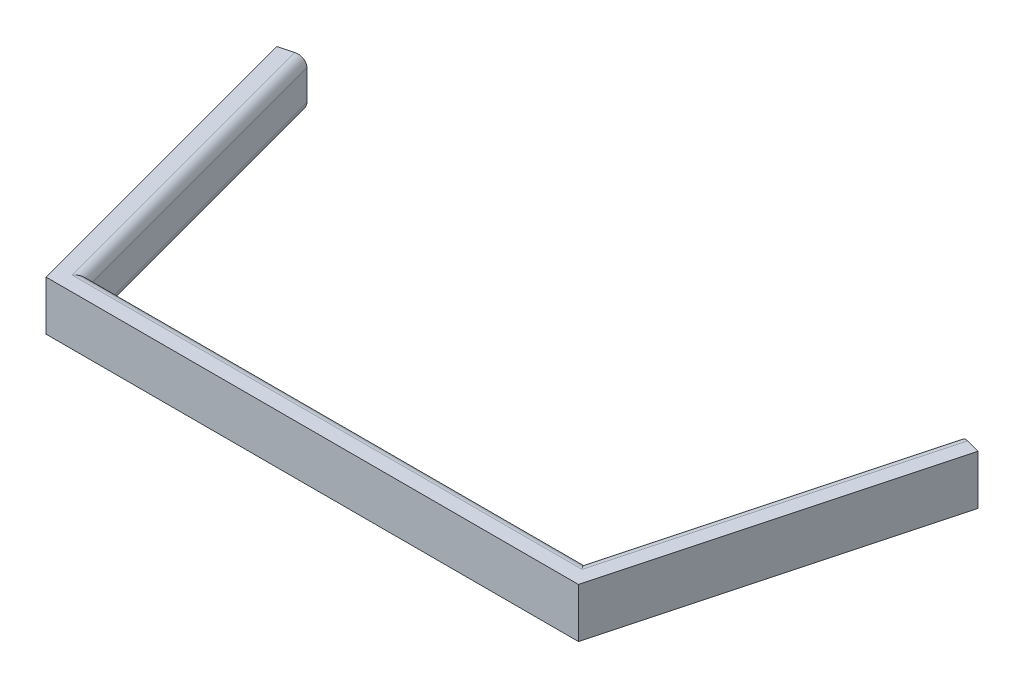
ISO-10303-21;
HEADER;
FILE_DESCRIPTION(('STEP AP214'),'2;1');
FILE_NAME('part.step','',(''),(''),'','','');
FILE_SCHEMA(('AUTOMOTIVE_DESIGN { 1 0 10303 214 1 1 1 1 }'));
ENDSEC;
DATA;
#1=APPLICATION_CONTEXT('core data for automotive mechanical design processes');
#2=APPLICATION_PROTOCOL_DEFINITION('international standard','automotive_design',2000,#1);
#3=PRODUCT_CONTEXT('',#1,'mechanical');
#4=PRODUCT('Part','Part','',(#3));
#5=PRODUCT_RELATED_PRODUCT_CATEGORY('part','',(#4));
#6=PRODUCT_DEFINITION_FORMATION('','',#4);
#7=PRODUCT_DEFINITION_CONTEXT('part definition',#1,'design');
#8=PRODUCT_DEFINITION('design','',#6,#7);
#9=PRODUCT_DEFINITION_SHAPE('','',#8);
#10=(LENGTH_UNIT() NAMED_UNIT(*) SI_UNIT(.MILLI.,.METRE.));
#11=(NAMED_UNIT(*) PLANE_ANGLE_UNIT() SI_UNIT($,.RADIAN.));
#12=(NAMED_UNIT(*) SI_UNIT($,.STERADIAN.) SOLID_ANGLE_UNIT());
#13=UNCERTAINTY_MEASURE_WITH_UNIT(LENGTH_MEASURE(1.E-05),#10,'distance_accuracy_value','');
#14=(GEOMETRIC_REPRESENTATION_CONTEXT(3) GLOBAL_UNCERTAINTY_ASSIGNED_CONTEXT((#13)) GLOBAL_UNIT_ASSIGNED_CONTEXT((#10,
#11,#12)) REPRESENTATION_CONTEXT('',''));
#15=CARTESIAN_POINT('',(0.,0.,0.));
#16=DIRECTION('',(0.,0.,1.));
#17=DIRECTION('',(1.,0.,0.));
#18=AXIS2_PLACEMENT_3D('',#15,#16,#17);
#19=CARTESIAN_POINT('',(-159.850411615286,12.7,-55.8538988702843));
#20=DIRECTION('',(-0.258819045102518,0.,-0.965925826289069));
#21=DIRECTION('',(-0.965925826289069,0.,0.258819045102518));
#22=AXIS2_PLACEMENT_3D('',#19,#20,#21);
#23=PLANE('',#22);
#24=DIRECTION('',(0.,-1.,0.));
#25=VECTOR('',#24,1.);
#26=CARTESIAN_POINT('',(-83.9177284632513,12.7,-76.2));
#27=LINE('',#26,#25);
#28=CARTESIAN_POINT('',(-83.9177284632513,10.16,-76.2));
#29=VERTEX_POINT('',#28);
#30=CARTESIAN_POINT('',(-83.9177284632513,2.54,-76.2));
#31=VERTEX_POINT('',#30);
#32=EDGE_CURVE('E154',#29,#31,#27,.T.);
#33=ORIENTED_EDGE('',*,*,#32,.T.);
#34=CARTESIAN_POINT('',(-86.3711800620255,2.54,-75.5425996254396));
#35=DIRECTION('',(-0.258819045102518,0.,-0.965925826289069));
#36=DIRECTION('',(-0.965925826289069,0.,0.258819045102518));
#37=AXIS2_PLACEMENT_3D('',#34,#35,#36);
#38=CIRCLE('',#37,2.54);
#39=CARTESIAN_POINT('',(-86.3711800620255,0.,-75.5425996254396));
#40=VERTEX_POINT('',#39);
#41=EDGE_CURVE('E194',#31,#40,#38,.T.);
#42=ORIENTED_EDGE('',*,*,#41,.T.);
#43=DIRECTION('',(0.965925826289069,0.,-0.258819045102518));
#44=VECTOR('',#43,1.);
#45=CARTESIAN_POINT('',(-159.850411615286,0.,-55.8538988702843));
#46=LINE('',#45,#44);
#47=CARTESIAN_POINT('',(-90.0513574601869,0.,-74.556499063599));
#48=VERTEX_POINT('',#47);
#49=EDGE_CURVE('E128',#48,#40,#46,.T.);
#50=ORIENTED_EDGE('',*,*,#49,.F.);
#51=DIRECTION('',(0.,-1.,0.));
#52=VECTOR('',#51,1.);
#53=CARTESIAN_POINT('',(-90.0513574601869,12.7,-74.556499063599));
#54=LINE('',#53,#52);
#55=CARTESIAN_POINT('',(-90.0513574601869,12.7,-74.556499063599));
#56=VERTEX_POINT('',#55);
#57=EDGE_CURVE('E122',#56,#48,#54,.T.);
#58=ORIENTED_EDGE('',*,*,#57,.F.);
#59=DIRECTION('',(0.965925826289069,0.,-0.258819045102518));
#60=VECTOR('',#59,1.);
#61=CARTESIAN_POINT('',(-159.850411615286,12.7,-55.8538988702843));
#62=LINE('',#61,#60);
#63=CARTESIAN_POINT('',(-86.3711800620255,12.7,-75.5425996254396));
#64=VERTEX_POINT('',#63);
#65=EDGE_CURVE('E125',#56,#64,#62,.T.);
#66=ORIENTED_EDGE('',*,*,#65,.T.);
#67=CARTESIAN_POINT('',(-86.3711800620255,10.16,-75.5425996254396));
#68=DIRECTION('',(-0.258819045102518,0.,-0.965925826289069));
#69=DIRECTION('',(-0.965925826289069,0.,0.258819045102518));
#70=AXIS2_PLACEMENT_3D('',#67,#68,#69);
#71=CIRCLE('',#70,2.54);
#72=EDGE_CURVE('E192',#64,#29,#71,.T.);
#73=ORIENTED_EDGE('',*,*,#72,.T.);
#74=EDGE_LOOP('',(#33,#42,#50,#58,#66,#73));
#75=FACE_BOUND('',#74,.T.);
#76=ADVANCED_FACE('F31',(#75),#23,.T.);
#77=CARTESIAN_POINT('',(-84.4434759094217,12.7,-53.6276001933147));
#78=DIRECTION('',(-0.965925826289069,0.,0.258819045102518));
#79=DIRECTION('',(0.258819045102518,0.,0.965925826289069));
#80=AXIS2_PLACEMENT_3D('',#77,#78,#79);
#81=PLANE('',#80);
#82=DIRECTION('',(-0.258819045102518,0.,-0.965925826289069));
#83=VECTOR('',#82,1.);
#84=CARTESIAN_POINT('',(-84.4434759094217,0.,-53.6276001933147));
#85=LINE('',#84,#83);
#86=CARTESIAN_POINT('',(-68.3725263736664,0.,6.35000000000002));
#87=VERTEX_POINT('',#86);
#88=EDGE_CURVE('E156',#87,#48,#85,.T.);
#89=ORIENTED_EDGE('',*,*,#88,.F.);
#90=DIRECTION('',(0.,-1.,0.));
#91=VECTOR('',#90,1.);
#92=CARTESIAN_POINT('',(-68.3725263736664,12.7,6.35000000000002));
#93=LINE('',#92,#91);
#94=CARTESIAN_POINT('',(-68.3725263736664,12.7,6.35000000000002));
#95=VERTEX_POINT('',#94);
#96=EDGE_CURVE('E134',#95,#87,#93,.T.);
#97=ORIENTED_EDGE('',*,*,#96,.F.);
#98=DIRECTION('',(-0.258819045102518,0.,-0.965925826289069));
#99=VECTOR('',#98,1.);
#100=CARTESIAN_POINT('',(-84.4434759094217,12.7,-53.6276001933147));
#101=LINE('',#100,#99);
#102=EDGE_CURVE('E140',#95,#56,#101,.T.);
#103=ORIENTED_EDGE('',*,*,#102,.T.);
#104=ORIENTED_EDGE('',*,*,#57,.T.);
#105=EDGE_LOOP('',(#89,#97,#103,#104));
#106=FACE_BOUND('',#105,.T.);
#107=ADVANCED_FACE('F145',(#106),#81,.T.);
#108=CARTESIAN_POINT('',(-154.24253006452,12.7,6.35000000000002));
#109=DIRECTION('',(0.,0.,1.));
#110=DIRECTION('',(1.,0.,0.));
#111=AXIS2_PLACEMENT_3D('',#108,#109,#110);
#112=PLANE('',#111);
#113=DIRECTION('',(-1.,0.,0.));
#114=VECTOR('',#113,1.);
#115=CARTESIAN_POINT('',(-154.24253006452,0.,6.35000000000002));
#116=LINE('',#115,#114);
#117=CARTESIAN_POINT('',(68.3725263736664,0.,6.35000000000002));
#118=VERTEX_POINT('',#117);
#119=EDGE_CURVE('E159',#118,#87,#116,.T.);
#120=ORIENTED_EDGE('',*,*,#119,.F.);
#121=DIRECTION('',(0.,-1.,0.));
#122=VECTOR('',#121,1.);
#123=CARTESIAN_POINT('',(68.3725263736664,12.7,6.35000000000002));
#124=LINE('',#123,#122);
#125=CARTESIAN_POINT('',(68.3725263736664,12.7,6.35000000000002));
#126=VERTEX_POINT('',#125);
#127=EDGE_CURVE('E179',#126,#118,#124,.T.);
#128=ORIENTED_EDGE('',*,*,#127,.F.);
#129=DIRECTION('',(-1.,0.,0.));
#130=VECTOR('',#129,1.);
#131=CARTESIAN_POINT('',(-154.24253006452,12.7,6.35000000000002));
#132=LINE('',#131,#130);
#133=EDGE_CURVE('E146',#126,#95,#132,.T.);
#134=ORIENTED_EDGE('',*,*,#133,.T.);
#135=ORIENTED_EDGE('',*,*,#96,.T.);
#136=EDGE_LOOP('',(#120,#128,#134,#135));
#137=FACE_BOUND('',#136,.T.);
#138=ADVANCED_FACE('F242',(#137),#112,.T.);
#139=CARTESIAN_POINT('',(63.7788952247614,12.7,23.4936648389447));
#140=DIRECTION('',(-0.965925826289069,0.,-0.258819045102518));
#141=DIRECTION('',(-0.258819045102518,0.,0.965925826289069));
#142=AXIS2_PLACEMENT_3D('',#139,#140,#141);
#143=PLANE('',#142);
#144=DIRECTION('',(0.258819045102518,0.,-0.965925826289069));
#145=VECTOR('',#144,1.);
#146=CARTESIAN_POINT('',(63.7788952247614,0.,23.4936648389447));
#147=LINE('',#146,#145);
#148=CARTESIAN_POINT('',(90.0513574601869,0.,-74.556499063599));
#149=VERTEX_POINT('',#148);
#150=EDGE_CURVE('E162',#118,#149,#147,.T.);
#151=ORIENTED_EDGE('',*,*,#150,.T.);
#152=DIRECTION('',(0.,-1.,0.));
#153=VECTOR('',#152,1.);
#154=CARTESIAN_POINT('',(90.0513574601869,12.7,-74.556499063599));
#155=LINE('',#154,#153);
#156=CARTESIAN_POINT('',(90.0513574601869,12.7,-74.556499063599));
#157=VERTEX_POINT('',#156);
#158=EDGE_CURVE('E176',#157,#149,#155,.T.);
#159=ORIENTED_EDGE('',*,*,#158,.F.);
#160=DIRECTION('',(0.258819045102518,0.,-0.965925826289069));
#161=VECTOR('',#160,1.);
#162=CARTESIAN_POINT('',(63.7788952247614,12.7,23.4936648389447));
#163=LINE('',#162,#161);
#164=EDGE_CURVE('E148',#126,#157,#163,.T.);
#165=ORIENTED_EDGE('',*,*,#164,.F.);
#166=ORIENTED_EDGE('',*,*,#127,.T.);
#167=EDGE_LOOP('',(#151,#159,#165,#166));
#168=FACE_BOUND('',#167,.T.);
#169=ADVANCED_FACE('F247',(#168),#143,.F.);
#170=CARTESIAN_POINT('',(-127.970067829095,12.7,-132.975163902544));
#171=DIRECTION('',(-0.258819045102518,0.,0.965925826289069));
#172=DIRECTION('',(0.965925826289069,0.,0.258819045102518));
#173=AXIS2_PLACEMENT_3D('',#170,#171,#172);
#174=PLANE('',#173);
#175=DIRECTION('',(-0.965925826289069,0.,-0.258819045102518));
#176=VECTOR('',#175,1.);
#177=CARTESIAN_POINT('',(-127.970067829095,0.,-132.975163902544));
#178=LINE('',#177,#176);
#179=CARTESIAN_POINT('',(86.3711800620256,0.,-75.5425996254396));
#180=VERTEX_POINT('',#179);
#181=EDGE_CURVE('E143',#149,#180,#178,.T.);
#182=ORIENTED_EDGE('',*,*,#181,.T.);
#183=CARTESIAN_POINT('',(86.3711800620255,2.54,-75.5425996254396));
#184=DIRECTION('',(-0.258819045102518,0.,0.965925826289069));
#185=DIRECTION('',(0.965925826289069,0.,0.258819045102518));
#186=AXIS2_PLACEMENT_3D('',#183,#184,#185);
#187=CIRCLE('',#186,2.54);
#188=CARTESIAN_POINT('',(83.9177284632513,2.54,-76.2));
#189=VERTEX_POINT('',#188);
#190=EDGE_CURVE('E206',#180,#189,#187,.F.);
#191=ORIENTED_EDGE('',*,*,#190,.T.);
#192=DIRECTION('',(0.,-1.,0.));
#193=VECTOR('',#192,1.);
#194=CARTESIAN_POINT('',(83.9177284632513,12.7,-76.2));
#195=LINE('',#194,#193);
#196=CARTESIAN_POINT('',(83.9177284632513,10.16,-76.2));
#197=VERTEX_POINT('',#196);
#198=EDGE_CURVE('E173',#197,#189,#195,.T.);
#199=ORIENTED_EDGE('',*,*,#198,.F.);
#200=CARTESIAN_POINT('',(86.3711800620256,10.16,-75.5425996254396));
#201=DIRECTION('',(-0.258819045102518,0.,0.965925826289069));
#202=DIRECTION('',(0.965925826289069,0.,0.258819045102518));
#203=AXIS2_PLACEMENT_3D('',#200,#201,#202);
#204=CIRCLE('',#203,2.54);
#205=CARTESIAN_POINT('',(86.3711800620256,12.7,-75.5425996254396));
#206=VERTEX_POINT('',#205);
#207=EDGE_CURVE('E204',#197,#206,#204,.F.);
#208=ORIENTED_EDGE('',*,*,#207,.T.);
#209=DIRECTION('',(-0.965925826289069,0.,-0.258819045102518));
#210=VECTOR('',#209,1.);
#211=CARTESIAN_POINT('',(-127.970067829095,12.7,-132.975163902544));
#212=LINE('',#211,#210);
#213=EDGE_CURVE('E152',#157,#206,#212,.T.);
#214=ORIENTED_EDGE('',*,*,#213,.F.);
#215=ORIENTED_EDGE('',*,*,#158,.T.);
#216=EDGE_LOOP('',(#182,#191,#199,#208,#214,#215));
#217=FACE_BOUND('',#216,.T.);
#218=ADVANCED_FACE('F249',(#217),#174,.F.);
#219=CARTESIAN_POINT('',(57.6452662278258,12.7,21.8501639025438));
#220=DIRECTION('',(0.965925826289069,0.,0.258819045102518));
#221=DIRECTION('',(0.258819045102518,0.,-0.965925826289069));
#222=AXIS2_PLACEMENT_3D('',#219,#220,#221);
#223=PLANE('',#222);
#224=ORIENTED_EDGE('',*,*,#198,.T.);
#225=DIRECTION('',(-0.258819045102518,0.,0.965925826289069));
#226=VECTOR('',#225,1.);
#227=CARTESIAN_POINT('',(57.6452662278258,2.54,21.8501639025438));
#228=LINE('',#227,#226);
#229=CARTESIAN_POINT('',(63.5,2.54,0.));
#230=VERTEX_POINT('',#229);
#231=EDGE_CURVE('E202',#189,#230,#228,.T.);
#232=ORIENTED_EDGE('',*,*,#231,.T.);
#233=DIRECTION('',(0.,-1.,0.));
#234=VECTOR('',#233,1.);
#235=CARTESIAN_POINT('',(63.5,12.7,0.));
#236=LINE('',#235,#234);
#237=CARTESIAN_POINT('',(63.5,10.16,0.));
#238=VERTEX_POINT('',#237);
#239=EDGE_CURVE('E170',#238,#230,#236,.T.);
#240=ORIENTED_EDGE('',*,*,#239,.F.);
#241=DIRECTION('',(-0.258819045102518,0.,0.965925826289069));
#242=VECTOR('',#241,1.);
#243=CARTESIAN_POINT('',(83.9177284632513,10.16,-76.2));
#244=LINE('',#243,#242);
#245=EDGE_CURVE('E200',#238,#197,#244,.F.);
#246=ORIENTED_EDGE('',*,*,#245,.T.);
#247=EDGE_LOOP('',(#224,#232,#240,#246));
#248=FACE_BOUND('',#247,.T.);
#249=ADVANCED_FACE('F255',(#248),#223,.F.);
#250=CARTESIAN_POINT('',(-154.24253006452,12.7,0.));
#251=DIRECTION('',(0.,0.,-1.));
#252=DIRECTION('',(-1.,0.,0.));
#253=AXIS2_PLACEMENT_3D('',#250,#251,#252);
#254=PLANE('',#253);
#255=ORIENTED_EDGE('',*,*,#239,.T.);
#256=DIRECTION('',(1.,0.,0.));
#257=VECTOR('',#256,1.);
#258=CARTESIAN_POINT('',(-63.5,2.54,0.));
#259=LINE('',#258,#257);
#260=CARTESIAN_POINT('',(-63.5,2.54,0.));
#261=VERTEX_POINT('',#260);
#262=EDGE_CURVE('E198',#230,#261,#259,.F.);
#263=ORIENTED_EDGE('',*,*,#262,.T.);
#264=DIRECTION('',(0.,-1.,0.));
#265=VECTOR('',#264,1.);
#266=CARTESIAN_POINT('',(-63.5,12.7,0.));
#267=LINE('',#266,#265);
#268=CARTESIAN_POINT('',(-63.5,10.16,0.));
#269=VERTEX_POINT('',#268);
#270=EDGE_CURVE('E167',#269,#261,#267,.T.);
#271=ORIENTED_EDGE('',*,*,#270,.F.);
#272=DIRECTION('',(1.,0.,0.));
#273=VECTOR('',#272,1.);
#274=CARTESIAN_POINT('',(-154.24253006452,10.16,0.));
#275=LINE('',#274,#273);
#276=EDGE_CURVE('E196',#269,#238,#275,.T.);
#277=ORIENTED_EDGE('',*,*,#276,.T.);
#278=EDGE_LOOP('',(#255,#263,#271,#277));
#279=FACE_BOUND('',#278,.T.);
#280=ADVANCED_FACE('F258',(#279),#254,.T.);
#281=CARTESIAN_POINT('',(-78.3098469124861,12.7,-55.2711011297157));
#282=DIRECTION('',(0.965925826289069,0.,-0.258819045102518));
#283=DIRECTION('',(-0.258819045102518,0.,-0.965925826289069));
#284=AXIS2_PLACEMENT_3D('',#281,#282,#283);
#285=PLANE('',#284);
#286=ORIENTED_EDGE('',*,*,#270,.T.);
#287=DIRECTION('',(0.258819045102518,0.,0.965925826289069));
#288=VECTOR('',#287,1.);
#289=CARTESIAN_POINT('',(-83.9177284632513,2.54,-76.2));
#290=LINE('',#289,#288);
#291=EDGE_CURVE('E190',#261,#31,#290,.F.);
#292=ORIENTED_EDGE('',*,*,#291,.T.);
#293=ORIENTED_EDGE('',*,*,#32,.F.);
#294=DIRECTION('',(0.258819045102518,0.,0.965925826289069));
#295=VECTOR('',#294,1.);
#296=CARTESIAN_POINT('',(-78.3098469124861,10.16,-55.2711011297157));
#297=LINE('',#296,#295);
#298=EDGE_CURVE('E188',#29,#269,#297,.T.);
#299=ORIENTED_EDGE('',*,*,#298,.T.);
#300=EDGE_LOOP('',(#286,#292,#293,#299));
#301=FACE_BOUND('',#300,.T.);
#302=ADVANCED_FACE('F223',(#301),#285,.T.);
#303=CARTESIAN_POINT('',(-154.24253006452,12.7,-34.925));
#304=DIRECTION('',(0.,1.,0.));
#305=DIRECTION('',(0.,0.,1.));
#306=AXIS2_PLACEMENT_3D('',#303,#304,#305);
#307=PLANE('',#306);
#308=ORIENTED_EDGE('',*,*,#213,.T.);
#309=DIRECTION('',(-0.258819045102518,0.,0.965925826289069));
#310=VECTOR('',#309,1.);
#311=CARTESIAN_POINT('',(65.9534515987743,12.7,0.657400374560402));
#312=LINE('',#311,#310);
#313=CARTESIAN_POINT('',(65.4490105494666,12.7,2.54));
#314=VERTEX_POINT('',#313);
#315=EDGE_CURVE('E11',#206,#314,#312,.T.);
#316=ORIENTED_EDGE('',*,*,#315,.T.);
#317=DIRECTION('',(1.,0.,0.));
#318=VECTOR('',#317,1.);
#319=CARTESIAN_POINT('',(-154.24253006452,12.7,2.54));
#320=LINE('',#319,#318);
#321=CARTESIAN_POINT('',(-65.4490105494666,12.7,2.54));
#322=VERTEX_POINT('',#321);
#323=EDGE_CURVE('E40',#314,#322,#320,.F.);
#324=ORIENTED_EDGE('',*,*,#323,.T.);
#325=DIRECTION('',(0.258819045102518,0.,0.965925826289069));
#326=VECTOR('',#325,1.);
#327=CARTESIAN_POINT('',(-80.7632985112603,12.7,-54.6137007551553));
#328=LINE('',#327,#326);
#329=EDGE_CURVE('E142',#322,#64,#328,.F.);
#330=ORIENTED_EDGE('',*,*,#329,.T.);
#331=ORIENTED_EDGE('',*,*,#65,.F.);
#332=ORIENTED_EDGE('',*,*,#102,.F.);
#333=ORIENTED_EDGE('',*,*,#133,.F.);
#334=ORIENTED_EDGE('',*,*,#164,.T.);
#335=EDGE_LOOP('',(#308,#316,#324,#330,#331,#332,#333,#334));
#336=FACE_BOUND('',#335,.T.);
#337=ADVANCED_FACE('F138',(#336),#307,.T.);
#338=CARTESIAN_POINT('',(-154.24253006452,0.,-34.925));
#339=DIRECTION('',(0.,1.,0.));
#340=DIRECTION('',(0.,0.,1.));
#341=AXIS2_PLACEMENT_3D('',#338,#339,#340);
#342=PLANE('',#341);
#343=ORIENTED_EDGE('',*,*,#49,.T.);
#344=DIRECTION('',(0.258819045102518,0.,0.965925826289069));
#345=VECTOR('',#344,1.);
#346=CARTESIAN_POINT('',(-65.9534515987742,0.,0.657400374560406));
#347=LINE('',#346,#345);
#348=CARTESIAN_POINT('',(-65.4490105494666,0.,2.54));
#349=VERTEX_POINT('',#348);
#350=EDGE_CURVE('E185',#40,#349,#347,.T.);
#351=ORIENTED_EDGE('',*,*,#350,.T.);
#352=DIRECTION('',(1.,0.,0.));
#353=VECTOR('',#352,1.);
#354=CARTESIAN_POINT('',(63.5,0.,2.54));
#355=LINE('',#354,#353);
#356=CARTESIAN_POINT('',(65.4490105494666,0.,2.54));
#357=VERTEX_POINT('',#356);
#358=EDGE_CURVE('E183',#349,#357,#355,.T.);
#359=ORIENTED_EDGE('',*,*,#358,.T.);
#360=DIRECTION('',(-0.258819045102518,0.,0.965925826289069));
#361=VECTOR('',#360,1.);
#362=CARTESIAN_POINT('',(60.0987178266001,0.,22.5075642771042));
#363=LINE('',#362,#361);
#364=EDGE_CURVE('E133',#357,#180,#363,.F.);
#365=ORIENTED_EDGE('',*,*,#364,.T.);
#366=ORIENTED_EDGE('',*,*,#181,.F.);
#367=ORIENTED_EDGE('',*,*,#150,.F.);
#368=ORIENTED_EDGE('',*,*,#119,.T.);
#369=ORIENTED_EDGE('',*,*,#88,.T.);
#370=EDGE_LOOP('',(#343,#351,#359,#365,#366,#367,#368,#369));
#371=FACE_BOUND('',#370,.T.);
#372=ADVANCED_FACE('F237',(#371),#342,.F.);
#373=CARTESIAN_POINT('',(60.0987178266001,2.54,22.5075642771042));
#374=DIRECTION('',(-0.258819045102518,0.,0.965925826289069));
#375=DIRECTION('',(0.965925826289069,0.,0.258819045102518));
#376=AXIS2_PLACEMENT_3D('',#373,#374,#375);
#377=CYLINDRICAL_SURFACE('',#376,2.54);
#378=ORIENTED_EDGE('',*,*,#190,.F.);
#379=ORIENTED_EDGE('',*,*,#364,.F.);
#380=CARTESIAN_POINT('',(65.4490105494666,2.54,2.54));
#381=DIRECTION('',(-0.793353340291234,0.,0.608761429008722));
#382=DIRECTION('',(-0.608761429008722,0.,-0.793353340291234));
#383=AXIS2_PLACEMENT_3D('',#380,#381,#382);
#384=ELLIPSE('',#383,3.20159993158608,2.54);
#385=EDGE_CURVE('E157',#230,#357,#384,.T.);
#386=ORIENTED_EDGE('',*,*,#385,.F.);
#387=ORIENTED_EDGE('',*,*,#231,.F.);
#388=EDGE_LOOP('',(#378,#379,#386,#387));
#389=FACE_BOUND('',#388,.T.);
#390=ADVANCED_FACE('F261',(#389),#377,.T.);
#391=CARTESIAN_POINT('',(-154.24253006452,2.54,2.54));
#392=DIRECTION('',(-1.,0.,0.));
#393=DIRECTION('',(0.,0.,1.));
#394=AXIS2_PLACEMENT_3D('',#391,#392,#393);
#395=CYLINDRICAL_SURFACE('',#394,2.54);
#396=ORIENTED_EDGE('',*,*,#385,.T.);
#397=ORIENTED_EDGE('',*,*,#358,.F.);
#398=CARTESIAN_POINT('',(-65.4490105494666,2.54,2.54));
#399=DIRECTION('',(-0.793353340291234,0.,-0.608761429008722));
#400=DIRECTION('',(0.608761429008722,0.,-0.793353340291234));
#401=AXIS2_PLACEMENT_3D('',#398,#399,#400);
#402=ELLIPSE('',#401,3.20159993158608,2.54);
#403=EDGE_CURVE('E210',#261,#349,#402,.T.);
#404=ORIENTED_EDGE('',*,*,#403,.F.);
#405=ORIENTED_EDGE('',*,*,#262,.F.);
#406=EDGE_LOOP('',(#396,#397,#404,#405));
#407=FACE_BOUND('',#406,.T.);
#408=ADVANCED_FACE('F233',(#407),#395,.T.);
#409=CARTESIAN_POINT('',(-80.7632985112603,2.54,-54.6137007551553));
#410=DIRECTION('',(-0.258819045102518,0.,-0.965925826289069));
#411=DIRECTION('',(-0.965925826289069,0.,0.258819045102518));
#412=AXIS2_PLACEMENT_3D('',#409,#410,#411);
#413=CYLINDRICAL_SURFACE('',#412,2.54);
#414=ORIENTED_EDGE('',*,*,#41,.F.);
#415=ORIENTED_EDGE('',*,*,#291,.F.);
#416=ORIENTED_EDGE('',*,*,#403,.T.);
#417=ORIENTED_EDGE('',*,*,#350,.F.);
#418=EDGE_LOOP('',(#414,#415,#416,#417));
#419=FACE_BOUND('',#418,.T.);
#420=ADVANCED_FACE('F228',(#419),#413,.T.);
#421=CARTESIAN_POINT('',(-80.7632985112603,10.16,-54.6137007551553));
#422=DIRECTION('',(0.258819045102518,0.,0.965925826289069));
#423=DIRECTION('',(0.965925826289069,0.,-0.258819045102518));
#424=AXIS2_PLACEMENT_3D('',#421,#422,#423);
#425=CYLINDRICAL_SURFACE('',#424,2.54);
#426=ORIENTED_EDGE('',*,*,#72,.F.);
#427=ORIENTED_EDGE('',*,*,#329,.F.);
#428=CARTESIAN_POINT('',(-65.4490105494666,10.16,2.54));
#429=DIRECTION('',(0.793353340291234,0.,0.608761429008722));
#430=DIRECTION('',(0.608761429008722,0.,-0.793353340291234));
#431=AXIS2_PLACEMENT_3D('',#428,#429,#430);
#432=ELLIPSE('',#431,3.20159993158608,2.54);
#433=EDGE_CURVE('E35',#269,#322,#432,.T.);
#434=ORIENTED_EDGE('',*,*,#433,.F.);
#435=ORIENTED_EDGE('',*,*,#298,.F.);
#436=EDGE_LOOP('',(#426,#427,#434,#435));
#437=FACE_BOUND('',#436,.T.);
#438=ADVANCED_FACE('F33',(#437),#425,.T.);
#439=CARTESIAN_POINT('',(-154.24253006452,10.16,2.54));
#440=DIRECTION('',(1.,0.,0.));
#441=DIRECTION('',(0.,0.,-1.));
#442=AXIS2_PLACEMENT_3D('',#439,#440,#441);
#443=CYLINDRICAL_SURFACE('',#442,2.54);
#444=ORIENTED_EDGE('',*,*,#433,.T.);
#445=ORIENTED_EDGE('',*,*,#323,.F.);
#446=CARTESIAN_POINT('',(65.4490105494666,10.16,2.54));
#447=DIRECTION('',(0.793353340291234,0.,-0.608761429008722));
#448=DIRECTION('',(-0.608761429008722,0.,-0.793353340291234));
#449=AXIS2_PLACEMENT_3D('',#446,#447,#448);
#450=ELLIPSE('',#449,3.20159993158608,2.54);
#451=EDGE_CURVE('E48',#238,#314,#450,.T.);
#452=ORIENTED_EDGE('',*,*,#451,.F.);
#453=ORIENTED_EDGE('',*,*,#276,.F.);
#454=EDGE_LOOP('',(#444,#445,#452,#453));
#455=FACE_BOUND('',#454,.T.);
#456=ADVANCED_FACE('F217',(#455),#443,.T.);
#457=CARTESIAN_POINT('',(60.0987178266001,10.16,22.5075642771042));
#458=DIRECTION('',(0.258819045102518,0.,-0.965925826289069));
#459=DIRECTION('',(-0.965925826289069,0.,-0.258819045102518));
#460=AXIS2_PLACEMENT_3D('',#457,#458,#459);
#461=CYLINDRICAL_SURFACE('',#460,2.54);
#462=ORIENTED_EDGE('',*,*,#207,.F.);
#463=ORIENTED_EDGE('',*,*,#245,.F.);
#464=ORIENTED_EDGE('',*,*,#451,.T.);
#465=ORIENTED_EDGE('',*,*,#315,.F.);
#466=EDGE_LOOP('',(#462,#463,#464,#465));
#467=FACE_BOUND('',#466,.T.);
#468=ADVANCED_FACE('F252',(#467),#461,.T.);
#469=CLOSED_SHELL('',(#76,#107,#138,#169,#218,#249,#280,#302,#337,#372,#390,#408,#420,#438,#456,#468));
#470=MANIFOLD_SOLID_BREP('B2',#469);
#471=ADVANCED_BREP_SHAPE_REPRESENTATION('',(#18,#470),#14);
#472=SHAPE_DEFINITION_REPRESENTATION(#9,#471);
ENDSEC;
END-ISO-10303-21;
